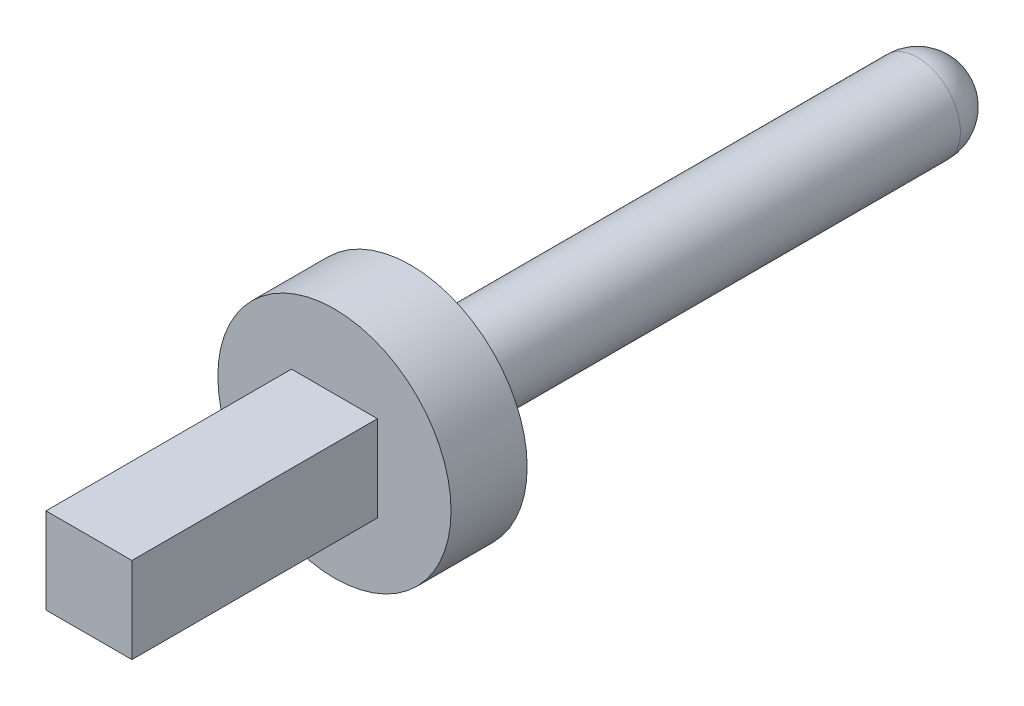
ISO-10303-21;
HEADER;
FILE_DESCRIPTION(('STEP AP214'),'2;1');
FILE_NAME('part.step','',(''),(''),'','','');
FILE_SCHEMA(('AUTOMOTIVE_DESIGN { 1 0 10303 214 1 1 1 1 }'));
ENDSEC;
DATA;
#1=APPLICATION_CONTEXT('core data for automotive mechanical design processes');
#2=APPLICATION_PROTOCOL_DEFINITION('international standard','automotive_design',2000,#1);
#3=PRODUCT_CONTEXT('',#1,'mechanical');
#4=PRODUCT('Part','Part','',(#3));
#5=PRODUCT_RELATED_PRODUCT_CATEGORY('part','',(#4));
#6=PRODUCT_DEFINITION_FORMATION('','',#4);
#7=PRODUCT_DEFINITION_CONTEXT('part definition',#1,'design');
#8=PRODUCT_DEFINITION('design','',#6,#7);
#9=PRODUCT_DEFINITION_SHAPE('','',#8);
#10=(LENGTH_UNIT() NAMED_UNIT(*) SI_UNIT(.MILLI.,.METRE.));
#11=(NAMED_UNIT(*) PLANE_ANGLE_UNIT() SI_UNIT($,.RADIAN.));
#12=(NAMED_UNIT(*) SI_UNIT($,.STERADIAN.) SOLID_ANGLE_UNIT());
#13=UNCERTAINTY_MEASURE_WITH_UNIT(LENGTH_MEASURE(1.E-05),#10,'distance_accuracy_value','');
#14=(GEOMETRIC_REPRESENTATION_CONTEXT(3) GLOBAL_UNCERTAINTY_ASSIGNED_CONTEXT((#13)) GLOBAL_UNIT_ASSIGNED_CONTEXT((#10,
#11,#12)) REPRESENTATION_CONTEXT('',''));
#15=CARTESIAN_POINT('',(0.,0.,0.));
#16=DIRECTION('',(0.,0.,1.));
#17=DIRECTION('',(1.,0.,0.));
#18=AXIS2_PLACEMENT_3D('',#15,#16,#17);
#19=CARTESIAN_POINT('',(-5.,2.25,-0.62));
#20=DIRECTION('',(0.,0.,-1.));
#21=DIRECTION('',(-1.,0.,0.));
#22=AXIS2_PLACEMENT_3D('',#19,#20,#21);
#23=CYLINDRICAL_SURFACE('',#22,0.95);
#24=CARTESIAN_POINT('',(-5.,2.25,-0.62));
#25=DIRECTION('',(0.,0.,1.));
#26=DIRECTION('',(0.,-1.,0.));
#27=AXIS2_PLACEMENT_3D('',#24,#25,#26);
#28=CIRCLE('',#27,0.95);
#29=CARTESIAN_POINT('',(-5.,1.3,-0.62));
#30=VERTEX_POINT('',#29);
#31=EDGE_CURVE('E28',#30,#30,#28,.T.);
#32=ORIENTED_EDGE('',*,*,#31,.T.);
#33=EDGE_LOOP('',(#32));
#34=FACE_BOUND('',#33,.T.);
#35=CARTESIAN_POINT('',(-5.,2.25,0.));
#36=DIRECTION('',(0.,0.,1.));
#37=DIRECTION('',(0.,-1.,0.));
#38=AXIS2_PLACEMENT_3D('',#35,#36,#37);
#39=CIRCLE('',#38,0.95);
#40=CARTESIAN_POINT('',(-5.,1.3,0.));
#41=VERTEX_POINT('',#40);
#42=EDGE_CURVE('E147',#41,#41,#39,.T.);
#43=ORIENTED_EDGE('',*,*,#42,.F.);
#44=EDGE_LOOP('',(#43));
#45=FACE_BOUND('',#44,.T.);
#46=ADVANCED_FACE('F17',(#34,#45),#23,.T.);
#47=CARTESIAN_POINT('',(-5.,2.25,-5.1));
#48=DIRECTION('',(0.,0.,-1.));
#49=DIRECTION('',(-1.,0.,0.));
#50=AXIS2_PLACEMENT_3D('',#47,#48,#49);
#51=CYLINDRICAL_SURFACE('',#50,0.35);
#52=CARTESIAN_POINT('',(-5.,2.25,-4.75));
#53=DIRECTION('',(0.,0.,1.));
#54=DIRECTION('',(-1.,0.,0.));
#55=AXIS2_PLACEMENT_3D('',#52,#53,#54);
#56=CIRCLE('',#55,0.35);
#57=CARTESIAN_POINT('',(-5.35,2.25,-4.75));
#58=VERTEX_POINT('',#57);
#59=EDGE_CURVE('E85',#58,#58,#56,.T.);
#60=ORIENTED_EDGE('',*,*,#59,.T.);
#61=EDGE_LOOP('',(#60));
#62=FACE_BOUND('',#61,.T.);
#63=CARTESIAN_POINT('',(-5.,2.25,-0.62));
#64=DIRECTION('',(0.,0.,1.));
#65=DIRECTION('',(0.,-1.,0.));
#66=AXIS2_PLACEMENT_3D('',#63,#64,#65);
#67=CIRCLE('',#66,0.35);
#68=CARTESIAN_POINT('',(-5.,1.9,-0.62));
#69=VERTEX_POINT('',#68);
#70=EDGE_CURVE('E11',#69,#69,#67,.T.);
#71=ORIENTED_EDGE('',*,*,#70,.F.);
#72=EDGE_LOOP('',(#71));
#73=FACE_BOUND('',#72,.T.);
#74=ADVANCED_FACE('F176',(#62,#73),#51,.T.);
#75=CARTESIAN_POINT('',(-5.,2.25,-0.62));
#76=DIRECTION('',(0.,0.,1.));
#77=DIRECTION('',(-1.,0.,0.));
#78=AXIS2_PLACEMENT_3D('',#75,#76,#77);
#79=PLANE('',#78);
#80=ORIENTED_EDGE('',*,*,#70,.T.);
#81=EDGE_LOOP('',(#80));
#82=FACE_BOUND('',#81,.T.);
#83=ORIENTED_EDGE('',*,*,#31,.F.);
#84=EDGE_LOOP('',(#83));
#85=FACE_BOUND('',#84,.T.);
#86=ADVANCED_FACE('F180',(#82,#85),#79,.F.);
#87=CARTESIAN_POINT('',(-5.,2.25,0.));
#88=DIRECTION('',(0.,0.,1.));
#89=DIRECTION('',(-1.,0.,0.));
#90=AXIS2_PLACEMENT_3D('',#87,#88,#89);
#91=PLANE('',#90);
#92=DIRECTION('',(-1.,0.,0.));
#93=VECTOR('',#92,1.);
#94=CARTESIAN_POINT('',(-4.65,2.6,0.));
#95=LINE('',#94,#93);
#96=CARTESIAN_POINT('',(-4.65,2.6,0.));
#97=VERTEX_POINT('',#96);
#98=CARTESIAN_POINT('',(-5.35,2.6,0.));
#99=VERTEX_POINT('',#98);
#100=EDGE_CURVE('E21',#97,#99,#95,.T.);
#101=ORIENTED_EDGE('',*,*,#100,.F.);
#102=DIRECTION('',(0.,1.,0.));
#103=VECTOR('',#102,1.);
#104=CARTESIAN_POINT('',(-4.65,1.9,0.));
#105=LINE('',#104,#103);
#106=CARTESIAN_POINT('',(-4.65,1.9,0.));
#107=VERTEX_POINT('',#106);
#108=EDGE_CURVE('E112',#107,#97,#105,.T.);
#109=ORIENTED_EDGE('',*,*,#108,.F.);
#110=DIRECTION('',(1.,0.,0.));
#111=VECTOR('',#110,1.);
#112=CARTESIAN_POINT('',(-5.35,1.9,0.));
#113=LINE('',#112,#111);
#114=CARTESIAN_POINT('',(-5.35,1.9,0.));
#115=VERTEX_POINT('',#114);
#116=EDGE_CURVE('E105',#115,#107,#113,.T.);
#117=ORIENTED_EDGE('',*,*,#116,.F.);
#118=DIRECTION('',(0.,-1.,0.));
#119=VECTOR('',#118,1.);
#120=CARTESIAN_POINT('',(-5.35,2.6,0.));
#121=LINE('',#120,#119);
#122=EDGE_CURVE('E109',#99,#115,#121,.T.);
#123=ORIENTED_EDGE('',*,*,#122,.F.);
#124=EDGE_LOOP('',(#101,#109,#117,#123));
#125=FACE_BOUND('',#124,.T.);
#126=ORIENTED_EDGE('',*,*,#42,.T.);
#127=EDGE_LOOP('',(#126));
#128=FACE_BOUND('',#127,.T.);
#129=ADVANCED_FACE('F106',(#125,#128),#91,.T.);
#130=CARTESIAN_POINT('',(-4.65,2.6,0.));
#131=DIRECTION('',(0.,1.,0.));
#132=DIRECTION('',(0.,0.,-1.));
#133=AXIS2_PLACEMENT_3D('',#130,#131,#132);
#134=PLANE('',#133);
#135=DIRECTION('',(-1.,0.,0.));
#136=VECTOR('',#135,1.);
#137=CARTESIAN_POINT('',(-4.65,2.6,2.));
#138=LINE('',#137,#136);
#139=CARTESIAN_POINT('',(-4.65,2.6,2.));
#140=VERTEX_POINT('',#139);
#141=CARTESIAN_POINT('',(-5.35,2.6,2.));
#142=VERTEX_POINT('',#141);
#143=EDGE_CURVE('E61',#140,#142,#138,.T.);
#144=ORIENTED_EDGE('',*,*,#143,.F.);
#145=DIRECTION('',(0.,0.,1.));
#146=VECTOR('',#145,1.);
#147=CARTESIAN_POINT('',(-4.65,2.6,0.));
#148=LINE('',#147,#146);
#149=EDGE_CURVE('E132',#97,#140,#148,.T.);
#150=ORIENTED_EDGE('',*,*,#149,.F.);
#151=ORIENTED_EDGE('',*,*,#100,.T.);
#152=DIRECTION('',(0.,0.,1.));
#153=VECTOR('',#152,1.);
#154=CARTESIAN_POINT('',(-5.35,2.6,0.));
#155=LINE('',#154,#153);
#156=EDGE_CURVE('E123',#99,#142,#155,.T.);
#157=ORIENTED_EDGE('',*,*,#156,.T.);
#158=EDGE_LOOP('',(#144,#150,#151,#157));
#159=FACE_BOUND('',#158,.T.);
#160=ADVANCED_FACE('F164',(#159),#134,.T.);
#161=CARTESIAN_POINT('',(-4.65,2.6,2.));
#162=DIRECTION('',(0.,0.,1.));
#163=DIRECTION('',(-1.,0.,0.));
#164=AXIS2_PLACEMENT_3D('',#161,#162,#163);
#165=PLANE('',#164);
#166=DIRECTION('',(0.,1.,0.));
#167=VECTOR('',#166,1.);
#168=CARTESIAN_POINT('',(-4.65,1.9,2.));
#169=LINE('',#168,#167);
#170=CARTESIAN_POINT('',(-4.65,1.9,2.));
#171=VERTEX_POINT('',#170);
#172=EDGE_CURVE('E139',#171,#140,#169,.T.);
#173=ORIENTED_EDGE('',*,*,#172,.T.);
#174=ORIENTED_EDGE('',*,*,#143,.T.);
#175=DIRECTION('',(0.,-1.,0.));
#176=VECTOR('',#175,1.);
#177=CARTESIAN_POINT('',(-5.35,2.6,2.));
#178=LINE('',#177,#176);
#179=CARTESIAN_POINT('',(-5.35,1.9,2.));
#180=VERTEX_POINT('',#179);
#181=EDGE_CURVE('E129',#142,#180,#178,.T.);
#182=ORIENTED_EDGE('',*,*,#181,.T.);
#183=DIRECTION('',(1.,0.,0.));
#184=VECTOR('',#183,1.);
#185=CARTESIAN_POINT('',(-5.35,1.9,2.));
#186=LINE('',#185,#184);
#187=EDGE_CURVE('E73',#180,#171,#186,.T.);
#188=ORIENTED_EDGE('',*,*,#187,.T.);
#189=EDGE_LOOP('',(#173,#174,#182,#188));
#190=FACE_BOUND('',#189,.T.);
#191=ADVANCED_FACE('F162',(#190),#165,.T.);
#192=CARTESIAN_POINT('',(-5.35,1.9,0.));
#193=DIRECTION('',(0.,-1.,0.));
#194=DIRECTION('',(-1.,0.,0.));
#195=AXIS2_PLACEMENT_3D('',#192,#193,#194);
#196=PLANE('',#195);
#197=ORIENTED_EDGE('',*,*,#187,.F.);
#198=DIRECTION('',(0.,0.,1.));
#199=VECTOR('',#198,1.);
#200=CARTESIAN_POINT('',(-5.35,1.9,0.));
#201=LINE('',#200,#199);
#202=EDGE_CURVE('E116',#115,#180,#201,.T.);
#203=ORIENTED_EDGE('',*,*,#202,.F.);
#204=ORIENTED_EDGE('',*,*,#116,.T.);
#205=DIRECTION('',(0.,0.,1.));
#206=VECTOR('',#205,1.);
#207=CARTESIAN_POINT('',(-4.65,1.9,0.));
#208=LINE('',#207,#206);
#209=EDGE_CURVE('E136',#107,#171,#208,.T.);
#210=ORIENTED_EDGE('',*,*,#209,.T.);
#211=EDGE_LOOP('',(#197,#203,#204,#210));
#212=FACE_BOUND('',#211,.T.);
#213=ADVANCED_FACE('F117',(#212),#196,.T.);
#214=CARTESIAN_POINT('',(-5.35,2.6,0.));
#215=DIRECTION('',(-1.,0.,0.));
#216=DIRECTION('',(0.,-1.,0.));
#217=AXIS2_PLACEMENT_3D('',#214,#215,#216);
#218=PLANE('',#217);
#219=ORIENTED_EDGE('',*,*,#181,.F.);
#220=ORIENTED_EDGE('',*,*,#156,.F.);
#221=ORIENTED_EDGE('',*,*,#122,.T.);
#222=ORIENTED_EDGE('',*,*,#202,.T.);
#223=EDGE_LOOP('',(#219,#220,#221,#222));
#224=FACE_BOUND('',#223,.T.);
#225=ADVANCED_FACE('F122',(#224),#218,.T.);
#226=CARTESIAN_POINT('',(-5.,2.25,-4.75));
#227=DIRECTION('',(0.,0.,1.));
#228=DIRECTION('',(-1.,0.,0.));
#229=AXIS2_PLACEMENT_3D('',#226,#227,#228);
#230=SPHERICAL_SURFACE('',#229,0.35);
#231=ORIENTED_EDGE('',*,*,#59,.F.);
#232=EDGE_LOOP('',(#231));
#233=FACE_BOUND('',#232,.T.);
#234=ADVANCED_FACE('F185',(#233),#230,.T.);
#235=CARTESIAN_POINT('',(-4.65,1.9,0.));
#236=DIRECTION('',(1.,0.,0.));
#237=DIRECTION('',(0.,0.,1.));
#238=AXIS2_PLACEMENT_3D('',#235,#236,#237);
#239=PLANE('',#238);
#240=ORIENTED_EDGE('',*,*,#172,.F.);
#241=ORIENTED_EDGE('',*,*,#209,.F.);
#242=ORIENTED_EDGE('',*,*,#108,.T.);
#243=ORIENTED_EDGE('',*,*,#149,.T.);
#244=EDGE_LOOP('',(#240,#241,#242,#243));
#245=FACE_BOUND('',#244,.T.);
#246=ADVANCED_FACE('F19',(#245),#239,.T.);
#247=CLOSED_SHELL('',(#46,#74,#86,#129,#160,#191,#213,#225,#234,#246));
#248=MANIFOLD_SOLID_BREP('B1',#247);
#249=ADVANCED_BREP_SHAPE_REPRESENTATION('',(#18,#248),#14);
#250=SHAPE_DEFINITION_REPRESENTATION(#9,#249);
ENDSEC;
END-ISO-10303-21;
